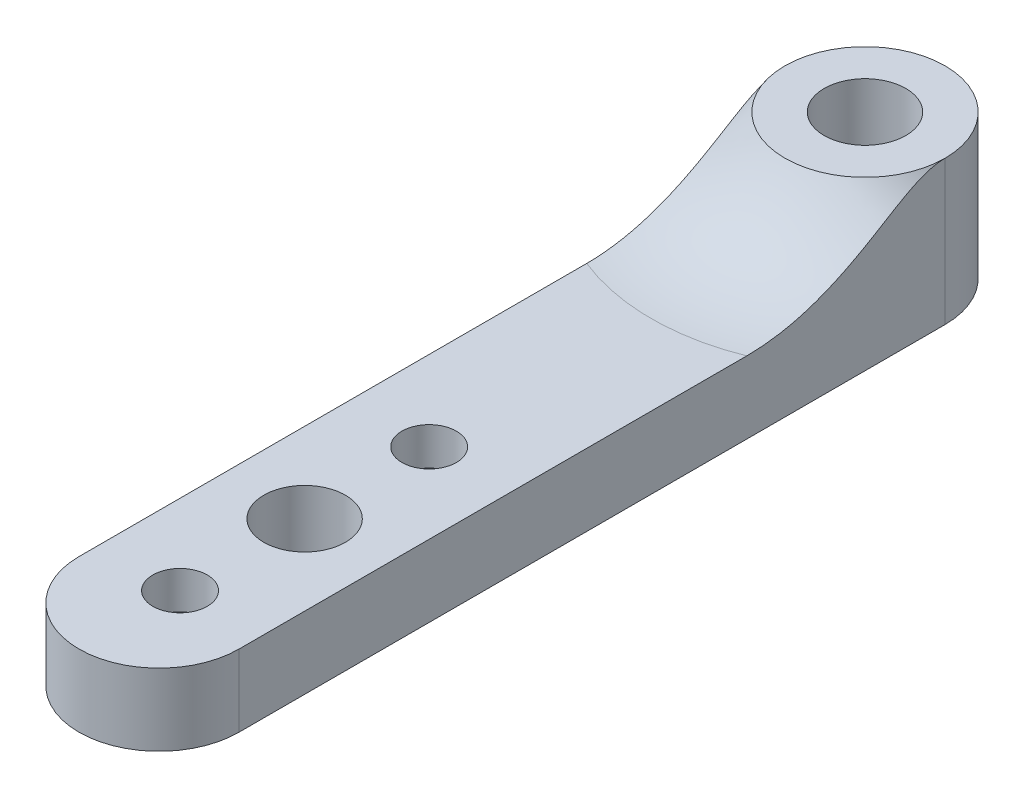
ISO-10303-21;
HEADER;
FILE_DESCRIPTION(('STEP AP214'),'2;1');
FILE_NAME('part.step','',(''),(''),'','','');
FILE_SCHEMA(('AUTOMOTIVE_DESIGN { 1 0 10303 214 1 1 1 1 }'));
ENDSEC;
DATA;
#1=APPLICATION_CONTEXT('core data for automotive mechanical design processes');
#2=APPLICATION_PROTOCOL_DEFINITION('international standard','automotive_design',2000,#1);
#3=PRODUCT_CONTEXT('',#1,'mechanical');
#4=PRODUCT('Part','Part','',(#3));
#5=PRODUCT_RELATED_PRODUCT_CATEGORY('part','',(#4));
#6=PRODUCT_DEFINITION_FORMATION('','',#4);
#7=PRODUCT_DEFINITION_CONTEXT('part definition',#1,'design');
#8=PRODUCT_DEFINITION('design','',#6,#7);
#9=PRODUCT_DEFINITION_SHAPE('','',#8);
#10=(LENGTH_UNIT() NAMED_UNIT(*) SI_UNIT(.MILLI.,.METRE.));
#11=(NAMED_UNIT(*) PLANE_ANGLE_UNIT() SI_UNIT($,.RADIAN.));
#12=(NAMED_UNIT(*) SI_UNIT($,.STERADIAN.) SOLID_ANGLE_UNIT());
#13=UNCERTAINTY_MEASURE_WITH_UNIT(LENGTH_MEASURE(1.E-05),#10,'distance_accuracy_value','');
#14=(GEOMETRIC_REPRESENTATION_CONTEXT(3) GLOBAL_UNCERTAINTY_ASSIGNED_CONTEXT((#13)) GLOBAL_UNIT_ASSIGNED_CONTEXT((#10,
#11,#12)) REPRESENTATION_CONTEXT('',''));
#15=CARTESIAN_POINT('',(0.,0.,0.));
#16=DIRECTION('',(0.,0.,1.));
#17=DIRECTION('',(1.,0.,0.));
#18=AXIS2_PLACEMENT_3D('',#15,#16,#17);
#19=CARTESIAN_POINT('',(0.,4.5,-17.5));
#20=DIRECTION('',(0.,-1.,0.));
#21=DIRECTION('',(0.,0.,-1.));
#22=AXIS2_PLACEMENT_3D('',#19,#20,#21);
#23=CYLINDRICAL_SURFACE('',#22,5.);
#24=CARTESIAN_POINT('',(0.,9.,-17.5));
#25=DIRECTION('',(0.,1.,0.));
#26=DIRECTION('',(0.,0.,1.));
#27=AXIS2_PLACEMENT_3D('',#24,#25,#26);
#28=CIRCLE('',#27,5.);
#29=CARTESIAN_POINT('',(5.,9.,-17.5));
#30=VERTEX_POINT('',#29);
#31=CARTESIAN_POINT('',(-5.,9.,-17.5));
#32=VERTEX_POINT('',#31);
#33=EDGE_CURVE('E116',#30,#32,#28,.T.);
#34=ORIENTED_EDGE('',*,*,#33,.F.);
#35=DIRECTION('',(0.,-1.,0.));
#36=VECTOR('',#35,1.);
#37=CARTESIAN_POINT('',(5.,4.5,-17.5));
#38=LINE('',#37,#36);
#39=CARTESIAN_POINT('',(5.,0.,-17.5));
#40=VERTEX_POINT('',#39);
#41=EDGE_CURVE('E92',#30,#40,#38,.T.);
#42=ORIENTED_EDGE('',*,*,#41,.T.);
#43=CARTESIAN_POINT('',(0.,0.,-17.5));
#44=DIRECTION('',(0.,1.,0.));
#45=DIRECTION('',(0.,0.,1.));
#46=AXIS2_PLACEMENT_3D('',#43,#44,#45);
#47=CIRCLE('',#46,5.);
#48=CARTESIAN_POINT('',(-5.,0.,-17.5));
#49=VERTEX_POINT('',#48);
#50=EDGE_CURVE('E123',#40,#49,#47,.T.);
#51=ORIENTED_EDGE('',*,*,#50,.T.);
#52=DIRECTION('',(0.,-1.,0.));
#53=VECTOR('',#52,1.);
#54=CARTESIAN_POINT('',(-5.,4.5,-17.5));
#55=LINE('',#54,#53);
#56=EDGE_CURVE('E138',#32,#49,#55,.T.);
#57=ORIENTED_EDGE('',*,*,#56,.F.);
#58=EDGE_LOOP('',(#34,#42,#51,#57));
#59=FACE_BOUND('',#58,.T.);
#60=ADVANCED_FACE('F36',(#59),#23,.T.);
#61=CARTESIAN_POINT('',(-5.,4.5,17.5));
#62=DIRECTION('',(1.,0.,0.));
#63=DIRECTION('',(0.,0.,-1.));
#64=AXIS2_PLACEMENT_3D('',#61,#62,#63);
#65=PLANE('',#64);
#66=DIRECTION('',(0.,0.,1.));
#67=VECTOR('',#66,1.);
#68=CARTESIAN_POINT('',(-5.,0.,17.5));
#69=LINE('',#68,#67);
#70=CARTESIAN_POINT('',(-5.,0.,26.5946336704579));
#71=VERTEX_POINT('',#70);
#72=EDGE_CURVE('E133',#49,#71,#69,.T.);
#73=ORIENTED_EDGE('',*,*,#72,.T.);
#74=DIRECTION('',(0.,-1.,0.));
#75=VECTOR('',#74,1.);
#76=CARTESIAN_POINT('',(-5.,21.7817446545309,26.5946336704579));
#77=LINE('',#76,#75);
#78=CARTESIAN_POINT('',(-5.,4.5,26.5946336704579));
#79=VERTEX_POINT('',#78);
#80=EDGE_CURVE('E102',#79,#71,#77,.T.);
#81=ORIENTED_EDGE('',*,*,#80,.F.);
#82=DIRECTION('',(0.,0.,1.));
#83=VECTOR('',#82,1.);
#84=CARTESIAN_POINT('',(-5.,4.5,17.5));
#85=LINE('',#84,#83);
#86=CARTESIAN_POINT('',(-5.,4.5,-5.11991658176528));
#87=VERTEX_POINT('',#86);
#88=EDGE_CURVE('E93',#87,#79,#85,.T.);
#89=ORIENTED_EDGE('',*,*,#88,.F.);
#90=CARTESIAN_POINT('',(-5.,4.5,-5.11991658176528));
#91=CARTESIAN_POINT('',(-5.,4.49999840549545,-5.29648181579723));
#92=CARTESIAN_POINT('',(-5.,4.50402126784642,-5.47301835966738));
#93=CARTESIAN_POINT('',(-5.,4.51994388788278,-5.82571573271794));
#94=CARTESIAN_POINT('',(-5.,4.53184269689178,-6.00187660458544));
#95=CARTESIAN_POINT('',(-5.,4.5790562478808,-6.52893211107319));
#96=CARTESIAN_POINT('',(-5.,4.62588901278066,-6.87885301045987));
#97=CARTESIAN_POINT('',(-5.,4.74799056085634,-7.57083933294123));
#98=CARTESIAN_POINT('',(-5.,4.8230395068316,-7.91294433442181));
#99=CARTESIAN_POINT('',(-5.,4.99942109009107,-8.59033950487401));
#100=CARTESIAN_POINT('',(-5.,5.10075775993142,-8.92562861976663));
#101=CARTESIAN_POINT('',(-5.,5.30621601387656,-9.52701597696135));
#102=CARTESIAN_POINT('',(-5.,5.40638556231449,-9.79448193987534));
#103=CARTESIAN_POINT('',(-5.,5.62080341708264,-10.3236568640424));
#104=CARTESIAN_POINT('',(-5.,5.73505015644983,-10.5853664622339));
#105=CARTESIAN_POINT('',(-5.,5.97586668590197,-11.1033151255615));
#106=CARTESIAN_POINT('',(-5.,6.10244795902924,-11.3595488169908));
#107=CARTESIAN_POINT('',(-5.,6.36565293956558,-11.8667286035166));
#108=CARTESIAN_POINT('',(-5.,6.50227531849063,-12.117675392462));
#109=CARTESIAN_POINT('',(-5.,6.72023308774814,-12.5041831534404));
#110=CARTESIAN_POINT('',(-5.,6.79900066904112,-12.641208333475));
#111=CARTESIAN_POINT('',(-5.,6.95826214067962,-12.9142528066188));
#112=CARTESIAN_POINT('',(-5.,7.03875604380955,-13.0502720922689));
#113=CARTESIAN_POINT('',(-5.,7.20090155578766,-13.3217439747389));
#114=CARTESIAN_POINT('',(-5.,7.28255393112967,-13.4571961114538));
#115=CARTESIAN_POINT('',(-5.,7.44620521482107,-13.7278848558966));
#116=CARTESIAN_POINT('',(-5.,7.52820411324867,-13.863121469645));
#117=CARTESIAN_POINT('',(-5.,7.69165565741036,-14.1340121555492));
#118=CARTESIAN_POINT('',(-5.,7.77310803062369,-14.2696663929483));
#119=CARTESIAN_POINT('',(-5.,7.93424650217102,-14.5420550112465));
#120=CARTESIAN_POINT('',(-5.,8.01393234208063,-14.6787895462643));
#121=CARTESIAN_POINT('',(-5.,8.16985605257228,-14.9540050276971));
#122=CARTESIAN_POINT('',(-5.,8.2460980340252,-15.0924836252912));
#123=CARTESIAN_POINT('',(-5.,8.39310819888435,-15.3722987187787));
#124=CARTESIAN_POINT('',(-5.,8.46387839508441,-15.5136341394253));
#125=CARTESIAN_POINT('',(-5.,8.58287468513335,-15.7696479007915));
#126=CARTESIAN_POINT('',(-5.,8.63268929566274,-15.8835804825039));
#127=CARTESIAN_POINT('',(-5.,8.72536806041057,-16.1143272272726));
#128=CARTESIAN_POINT('',(-5.,8.76822990025216,-16.2311423349921));
#129=CARTESIAN_POINT('',(-5.,8.84458191982192,-16.4669526784213));
#130=CARTESIAN_POINT('',(-5.,8.8781348763189,-16.5859272435732));
#131=CARTESIAN_POINT('',(-5.,8.93400144195459,-16.8264426348765));
#132=CARTESIAN_POINT('',(-5.,8.956326587114,-16.9479806927949));
#133=CARTESIAN_POINT('',(-5.,8.98129417927739,-17.1414076447847));
#134=CARTESIAN_POINT('',(-5.,8.98826445230985,-17.2127514064984));
#135=CARTESIAN_POINT('',(-5.,8.99763873672288,-17.3560557270254));
#136=CARTESIAN_POINT('',(-5.,9.00002227175152,-17.4280176177274));
#137=CARTESIAN_POINT('',(-5.,9.,-17.5));
#138=B_SPLINE_CURVE_WITH_KNOTS('',3,(#90,#91,#92,#93,#94,#95,#96,#97,#98,#99,#100,#101,#102,
#103,#104,#105,#106,#107,#108,#109,#110,#111,#112,#113,#114,#115,#116,#117,#118,#119,#120,#121,
#122,#123,#124,#125,#126,#127,#128,#129,#130,#131,#132,#133,#134,#135,#136,#137),.UNSPECIFIED.,
.F.,.F.,(4,2,2,2,2,2,2,2,2,2,2,2,2,2,2,2,2,2,2,2,2,2,2,4),(0.,0.529596670185663,
1.05912956080555,2.11684002814387,3.16647494253158,4.21627096699879,5.07267525956277,
5.92898430985545,6.78609831350219,7.6430991204991,8.11724230026892,8.59138899255668,
9.06586556542707,9.54032864370225,10.0150129440297,10.4897662332263,10.9639369735917,
11.4379324523076,11.8108050822626,12.1838015771886,12.5542178974807,12.9242528518082,
13.1391667154999,13.3550378030074),.UNSPECIFIED.);
#139=EDGE_CURVE('E11',#87,#32,#138,.T.);
#140=ORIENTED_EDGE('',*,*,#139,.T.);
#141=ORIENTED_EDGE('',*,*,#56,.T.);
#142=EDGE_LOOP('',(#73,#81,#89,#140,#141));
#143=FACE_BOUND('',#142,.T.);
#144=ADVANCED_FACE('F149',(#143),#65,.F.);
#145=CARTESIAN_POINT('',(5.,4.5,17.5));
#146=DIRECTION('',(-1.,0.,0.));
#147=DIRECTION('',(0.,0.,1.));
#148=AXIS2_PLACEMENT_3D('',#145,#146,#147);
#149=PLANE('',#148);
#150=DIRECTION('',(0.,0.,-1.));
#151=VECTOR('',#150,1.);
#152=CARTESIAN_POINT('',(5.,0.,17.5));
#153=LINE('',#152,#151);
#154=CARTESIAN_POINT('',(5.,0.,26.5946336704579));
#155=VERTEX_POINT('',#154);
#156=EDGE_CURVE('E129',#155,#40,#153,.T.);
#157=ORIENTED_EDGE('',*,*,#156,.T.);
#158=ORIENTED_EDGE('',*,*,#41,.F.);
#159=CARTESIAN_POINT('',(5.,9.,-17.5));
#160=CARTESIAN_POINT('',(5.,9.00000893187561,-17.4407571857202));
#161=CARTESIAN_POINT('',(5.,8.99840009437402,-17.3815266132419));
#162=CARTESIAN_POINT('',(5.,8.99202876035376,-17.2632544098129));
#163=CARTESIAN_POINT('',(5.,8.98726731139348,-17.2042127226449));
#164=CARTESIAN_POINT('',(5.,8.96842430181486,-17.0280181132181));
#165=CARTESIAN_POINT('',(5.,8.94978278565232,-16.9113310846864));
#166=CARTESIAN_POINT('',(5.,8.90230736154222,-16.6827192850576));
#167=CARTESIAN_POINT('',(5.,8.8736991741825,-16.5707460207778));
#168=CARTESIAN_POINT('',(5.,8.80800109977393,-16.3492956485838));
#169=CARTESIAN_POINT('',(5.,8.77090689076764,-16.239819843986));
#170=CARTESIAN_POINT('',(5.,8.65944374051665,-15.9414933196581));
#171=CARTESIAN_POINT('',(5.,8.57811070655369,-15.7552728604319));
#172=CARTESIAN_POINT('',(5.,8.40277292471352,-15.3888247195622));
#173=CARTESIAN_POINT('',(5.,8.30875044569528,-15.2086058714358));
#174=CARTESIAN_POINT('',(5.,8.11316566426022,-14.8513923676943));
#175=CARTESIAN_POINT('',(5.,8.01157379232076,-14.6744141255171));
#176=CARTESIAN_POINT('',(5.,7.80500355423442,-14.3226125895224));
#177=CARTESIAN_POINT('',(5.,7.70002714763805,-14.1477881269809));
#178=CARTESIAN_POINT('',(5.,7.48682567963583,-13.7946600515054));
#179=CARTESIAN_POINT('',(5.,7.37858120057766,-13.6163682301553));
#180=CARTESIAN_POINT('',(5.,7.16323400774345,-13.2590631515509));
#181=CARTESIAN_POINT('',(5.,7.05613142898407,-13.0800498123593));
#182=CARTESIAN_POINT('',(5.,6.84488124287006,-12.7208346361355));
#183=CARTESIAN_POINT('',(5.,6.7407273815143,-12.5406364993791));
#184=CARTESIAN_POINT('',(5.,6.53636676638719,-12.1780155341045));
#185=CARTESIAN_POINT('',(5.,6.43615986332677,-11.995592790072));
#186=CARTESIAN_POINT('',(5.,6.24120705665234,-11.6289733585168));
#187=CARTESIAN_POINT('',(5.,6.14643700007078,-11.4447895847986));
#188=CARTESIAN_POINT('',(5.,5.9627256594043,-11.0735389332999));
#189=CARTESIAN_POINT('',(5.,5.87378449519792,-10.8864719963212));
#190=CARTESIAN_POINT('',(5.,5.61678795147896,-10.320451895944));
#191=CARTESIAN_POINT('',(5.,5.45867079781858,-9.93688480122822));
#192=CARTESIAN_POINT('',(5.,5.17536373698116,-9.16043229289621));
#193=CARTESIAN_POINT('',(5.,5.04997258997727,-8.76762084224966));
#194=CARTESIAN_POINT('',(5.,4.83527822520325,-7.97243390610871));
#195=CARTESIAN_POINT('',(5.,4.74594962223819,-7.57006536005334));
#196=CARTESIAN_POINT('',(5.,4.61861603543272,-6.8270344533577));
#197=CARTESIAN_POINT('',(5.,4.57449135018649,-6.48742639817937));
#198=CARTESIAN_POINT('',(5.,4.53000382038349,-5.97593160131117));
#199=CARTESIAN_POINT('',(5.,4.51879095517126,-5.80494327635177));
#200=CARTESIAN_POINT('',(5.,4.50378742020659,-5.46261668731822));
#201=CARTESIAN_POINT('',(5.,4.49999786261868,-5.29127837465745));
#202=CARTESIAN_POINT('',(5.,4.5,-5.11991658176528));
#203=B_SPLINE_CURVE_WITH_KNOTS('',3,(#159,#160,#161,#162,#163,#164,#165,#166,#167,#168,#169,
#170,#171,#172,#173,#174,#175,#176,#177,#178,#179,#180,#181,#182,#183,#184,#185,#186,#187,#188,
#189,#190,#191,#192,#193,#194,#195,#196,#197,#198,#199,#200,#201,#202),.UNSPECIFIED.,.F.,.F.,(4,
2,2,2,2,2,2,2,2,2,2,2,2,2,2,2,2,2,2,2,2,4),(0.,0.177683781197214,0.35530855075048,
0.709171510429659,1.05549186916257,1.40198900417043,2.01071252515322,2.62029560475884,
3.23239930772968,3.84415476847003,4.46989024990625,5.0956989147171,5.72006208176829,
6.34440161029239,6.96570972074269,7.5870306051717,8.83037167554732,10.0658767292057,
11.300510561635,12.3266475481923,12.8405707795262,13.3545710012691),.UNSPECIFIED.);
#204=CARTESIAN_POINT('',(5.,4.5,-5.11991658176528));
#205=VERTEX_POINT('',#204);
#206=EDGE_CURVE('E50',#30,#205,#203,.T.);
#207=ORIENTED_EDGE('',*,*,#206,.T.);
#208=DIRECTION('',(0.,0.,-1.));
#209=VECTOR('',#208,1.);
#210=CARTESIAN_POINT('',(5.,4.5,17.5));
#211=LINE('',#210,#209);
#212=CARTESIAN_POINT('',(5.,4.5,26.5946336704579));
#213=VERTEX_POINT('',#212);
#214=EDGE_CURVE('E86',#213,#205,#211,.T.);
#215=ORIENTED_EDGE('',*,*,#214,.F.);
#216=DIRECTION('',(0.,-1.,0.));
#217=VECTOR('',#216,1.);
#218=CARTESIAN_POINT('',(5.,21.7817446545309,26.5946336704579));
#219=LINE('',#218,#217);
#220=EDGE_CURVE('E90',#213,#155,#219,.T.);
#221=ORIENTED_EDGE('',*,*,#220,.T.);
#222=EDGE_LOOP('',(#157,#158,#207,#215,#221));
#223=FACE_BOUND('',#222,.T.);
#224=ADVANCED_FACE('F88',(#223),#149,.F.);
#225=CARTESIAN_POINT('',(0.,4.5,-17.5));
#226=DIRECTION('',(0.,1.,0.));
#227=DIRECTION('',(0.,0.,1.));
#228=AXIS2_PLACEMENT_3D('',#225,#226,#227);
#229=PLANE('',#228);
#230=CARTESIAN_POINT('',(0.,4.5,9.72));
#231=DIRECTION('',(0.,1.,0.));
#232=DIRECTION('',(0.,0.,1.));
#233=AXIS2_PLACEMENT_3D('',#230,#231,#232);
#234=CIRCLE('',#233,1.7);
#235=CARTESIAN_POINT('',(0.,4.5,11.42));
#236=VERTEX_POINT('',#235);
#237=EDGE_CURVE('E241',#236,#236,#234,.T.);
#238=ORIENTED_EDGE('',*,*,#237,.F.);
#239=EDGE_LOOP('',(#238));
#240=FACE_BOUND('',#239,.T.);
#241=CARTESIAN_POINT('',(0.,4.5,25.28));
#242=DIRECTION('',(0.,1.,0.));
#243=DIRECTION('',(0.,0.,1.));
#244=AXIS2_PLACEMENT_3D('',#241,#242,#243);
#245=CIRCLE('',#244,1.7);
#246=CARTESIAN_POINT('',(0.,4.5,26.98));
#247=VERTEX_POINT('',#246);
#248=EDGE_CURVE('E108',#247,#247,#245,.T.);
#249=ORIENTED_EDGE('',*,*,#248,.F.);
#250=EDGE_LOOP('',(#249));
#251=FACE_BOUND('',#250,.T.);
#252=ORIENTED_EDGE('',*,*,#214,.T.);
#253=CARTESIAN_POINT('',(0.,4.5,-17.5));
#254=DIRECTION('',(0.,1.,0.));
#255=DIRECTION('',(0.,0.,1.));
#256=AXIS2_PLACEMENT_3D('',#253,#254,#255);
#257=CIRCLE('',#256,13.351646544245);
#258=EDGE_CURVE('E63',#205,#87,#257,.F.);
#259=ORIENTED_EDGE('',*,*,#258,.T.);
#260=ORIENTED_EDGE('',*,*,#88,.T.);
#261=CARTESIAN_POINT('',(0.,4.5,26.5946336704579));
#262=DIRECTION('',(0.,1.,0.));
#263=DIRECTION('',(0.,0.,1.));
#264=AXIS2_PLACEMENT_3D('',#261,#262,#263);
#265=CIRCLE('',#264,5.);
#266=EDGE_CURVE('E96',#213,#79,#265,.F.);
#267=ORIENTED_EDGE('',*,*,#266,.F.);
#268=EDGE_LOOP('',(#252,#259,#260,#267));
#269=FACE_BOUND('',#268,.T.);
#270=CARTESIAN_POINT('',(0.,4.5,17.5));
#271=DIRECTION('',(0.,1.,0.));
#272=DIRECTION('',(0.,0.,1.));
#273=AXIS2_PLACEMENT_3D('',#270,#271,#272);
#274=CIRCLE('',#273,2.55);
#275=CARTESIAN_POINT('',(0.,4.5,20.05));
#276=VERTEX_POINT('',#275);
#277=EDGE_CURVE('E119',#276,#276,#274,.T.);
#278=ORIENTED_EDGE('',*,*,#277,.F.);
#279=EDGE_LOOP('',(#278));
#280=FACE_BOUND('',#279,.T.);
#281=ADVANCED_FACE('F97',(#240,#251,#269,#280),#229,.T.);
#282=CARTESIAN_POINT('',(0.,0.,-17.5));
#283=DIRECTION('',(0.,1.,0.));
#284=DIRECTION('',(0.,0.,1.));
#285=AXIS2_PLACEMENT_3D('',#282,#283,#284);
#286=PLANE('',#285);
#287=CARTESIAN_POINT('',(0.,0.,9.72));
#288=DIRECTION('',(0.,-1.,0.));
#289=DIRECTION('',(0.,0.,-1.));
#290=AXIS2_PLACEMENT_3D('',#287,#288,#289);
#291=CIRCLE('',#290,3.35);
#292=CARTESIAN_POINT('',(0.,0.,6.37));
#293=VERTEX_POINT('',#292);
#294=EDGE_CURVE('E182',#293,#293,#291,.T.);
#295=ORIENTED_EDGE('',*,*,#294,.F.);
#296=EDGE_LOOP('',(#295));
#297=FACE_BOUND('',#296,.T.);
#298=CARTESIAN_POINT('',(0.,0.,25.28));
#299=DIRECTION('',(0.,-1.,0.));
#300=DIRECTION('',(0.,0.,-1.));
#301=AXIS2_PLACEMENT_3D('',#298,#299,#300);
#302=CIRCLE('',#301,3.35);
#303=CARTESIAN_POINT('',(0.,0.,21.93));
#304=VERTEX_POINT('',#303);
#305=EDGE_CURVE('E186',#304,#304,#302,.T.);
#306=ORIENTED_EDGE('',*,*,#305,.F.);
#307=EDGE_LOOP('',(#306));
#308=FACE_BOUND('',#307,.T.);
#309=CARTESIAN_POINT('',(0.,0.,-17.5));
#310=DIRECTION('',(0.,1.,0.));
#311=DIRECTION('',(0.,0.,1.));
#312=AXIS2_PLACEMENT_3D('',#309,#310,#311);
#313=CIRCLE('',#312,2.55);
#314=CARTESIAN_POINT('',(0.,0.,-14.95));
#315=VERTEX_POINT('',#314);
#316=EDGE_CURVE('E120',#315,#315,#313,.T.);
#317=ORIENTED_EDGE('',*,*,#316,.T.);
#318=EDGE_LOOP('',(#317));
#319=FACE_BOUND('',#318,.T.);
#320=CARTESIAN_POINT('',(0.,0.,17.5));
#321=DIRECTION('',(0.,1.,0.));
#322=DIRECTION('',(0.,0.,1.));
#323=AXIS2_PLACEMENT_3D('',#320,#321,#322);
#324=CIRCLE('',#323,2.55);
#325=CARTESIAN_POINT('',(0.,0.,20.05));
#326=VERTEX_POINT('',#325);
#327=EDGE_CURVE('E124',#326,#326,#324,.T.);
#328=ORIENTED_EDGE('',*,*,#327,.T.);
#329=EDGE_LOOP('',(#328));
#330=FACE_BOUND('',#329,.T.);
#331=ORIENTED_EDGE('',*,*,#50,.F.);
#332=ORIENTED_EDGE('',*,*,#156,.F.);
#333=CARTESIAN_POINT('',(0.,0.,26.5946336704579));
#334=DIRECTION('',(0.,-1.,0.));
#335=DIRECTION('',(0.,0.,-1.));
#336=AXIS2_PLACEMENT_3D('',#333,#334,#335);
#337=CIRCLE('',#336,5.);
#338=EDGE_CURVE('E106',#155,#71,#337,.T.);
#339=ORIENTED_EDGE('',*,*,#338,.T.);
#340=ORIENTED_EDGE('',*,*,#72,.F.);
#341=EDGE_LOOP('',(#331,#332,#339,#340));
#342=FACE_BOUND('',#341,.T.);
#343=ADVANCED_FACE('F150',(#297,#308,#319,#330,#342),#286,.F.);
#344=CARTESIAN_POINT('',(0.,0.,17.5));
#345=DIRECTION('',(0.,1.,0.));
#346=DIRECTION('',(0.,0.,1.));
#347=AXIS2_PLACEMENT_3D('',#344,#345,#346);
#348=CYLINDRICAL_SURFACE('',#347,2.55);
#349=ORIENTED_EDGE('',*,*,#327,.F.);
#350=EDGE_LOOP('',(#349));
#351=FACE_BOUND('',#350,.T.);
#352=ORIENTED_EDGE('',*,*,#277,.T.);
#353=EDGE_LOOP('',(#352));
#354=FACE_BOUND('',#353,.T.);
#355=ADVANCED_FACE('F169',(#351,#354),#348,.F.);
#356=CARTESIAN_POINT('',(0.,0.,-17.5));
#357=DIRECTION('',(0.,1.,0.));
#358=DIRECTION('',(0.,0.,1.));
#359=AXIS2_PLACEMENT_3D('',#356,#357,#358);
#360=CYLINDRICAL_SURFACE('',#359,2.55);
#361=ORIENTED_EDGE('',*,*,#316,.F.);
#362=EDGE_LOOP('',(#361));
#363=FACE_BOUND('',#362,.T.);
#364=CARTESIAN_POINT('',(0.,9.,-17.5));
#365=DIRECTION('',(0.,-1.,0.));
#366=DIRECTION('',(0.,0.,-1.));
#367=AXIS2_PLACEMENT_3D('',#364,#365,#366);
#368=CIRCLE('',#367,2.55);
#369=CARTESIAN_POINT('',(0.,9.,-20.05));
#370=VERTEX_POINT('',#369);
#371=EDGE_CURVE('E112',#370,#370,#368,.T.);
#372=ORIENTED_EDGE('',*,*,#371,.F.);
#373=EDGE_LOOP('',(#372));
#374=FACE_BOUND('',#373,.T.);
#375=ADVANCED_FACE('F175',(#363,#374),#360,.F.);
#376=CARTESIAN_POINT('',(0.,9.,-17.5));
#377=DIRECTION('',(0.,1.,0.));
#378=DIRECTION('',(0.,0.,1.));
#379=AXIS2_PLACEMENT_3D('',#376,#377,#378);
#380=PLANE('',#379);
#381=ORIENTED_EDGE('',*,*,#371,.T.);
#382=EDGE_LOOP('',(#381));
#383=FACE_BOUND('',#382,.T.);
#384=ORIENTED_EDGE('',*,*,#33,.T.);
#385=EDGE_CURVE('E115',#32,#30,#28,.T.);
#386=ORIENTED_EDGE('',*,*,#385,.T.);
#387=EDGE_LOOP('',(#384,#386));
#388=FACE_BOUND('',#387,.T.);
#389=ADVANCED_FACE('F164',(#383,#388),#380,.T.);
#390=CARTESIAN_POINT('',(0.,21.7817446545309,26.5946336704579));
#391=DIRECTION('',(0.,-1.,0.));
#392=DIRECTION('',(0.,0.,-1.));
#393=AXIS2_PLACEMENT_3D('',#390,#391,#392);
#394=CYLINDRICAL_SURFACE('',#393,5.);
#395=ORIENTED_EDGE('',*,*,#220,.F.);
#396=ORIENTED_EDGE('',*,*,#266,.T.);
#397=ORIENTED_EDGE('',*,*,#80,.T.);
#398=ORIENTED_EDGE('',*,*,#338,.F.);
#399=EDGE_LOOP('',(#395,#396,#397,#398));
#400=FACE_BOUND('',#399,.T.);
#401=ADVANCED_FACE('F104',(#400),#394,.T.);
#402=CARTESIAN_POINT('',(0.,0.,25.28));
#403=DIRECTION('',(0.,-1.,0.));
#404=DIRECTION('',(0.,0.,-1.));
#405=AXIS2_PLACEMENT_3D('',#402,#403,#404);
#406=CYLINDRICAL_SURFACE('',#405,1.7);
#407=CARTESIAN_POINT('',(0.,2.15,25.28));
#408=DIRECTION('',(0.,-1.,0.));
#409=DIRECTION('',(0.,0.,-1.));
#410=AXIS2_PLACEMENT_3D('',#407,#408,#409);
#411=CIRCLE('',#410,1.7);
#412=CARTESIAN_POINT('',(0.,2.15,23.58));
#413=VERTEX_POINT('',#412);
#414=EDGE_CURVE('E248',#413,#413,#411,.T.);
#415=ORIENTED_EDGE('',*,*,#414,.T.);
#416=EDGE_LOOP('',(#415));
#417=FACE_BOUND('',#416,.T.);
#418=ORIENTED_EDGE('',*,*,#248,.T.);
#419=EDGE_LOOP('',(#418));
#420=FACE_BOUND('',#419,.T.);
#421=ADVANCED_FACE('F203',(#417,#420),#406,.F.);
#422=CARTESIAN_POINT('',(1.7,2.15,25.28));
#423=DIRECTION('',(0.,1.,0.));
#424=DIRECTION('',(0.,0.,1.));
#425=AXIS2_PLACEMENT_3D('',#422,#423,#424);
#426=PLANE('',#425);
#427=ORIENTED_EDGE('',*,*,#414,.F.);
#428=EDGE_LOOP('',(#427));
#429=FACE_BOUND('',#428,.T.);
#430=CARTESIAN_POINT('',(0.,2.15,25.28));
#431=DIRECTION('',(0.,-1.,0.));
#432=DIRECTION('',(0.,0.,-1.));
#433=AXIS2_PLACEMENT_3D('',#430,#431,#432);
#434=CIRCLE('',#433,3.35);
#435=CARTESIAN_POINT('',(0.,2.15,21.93));
#436=VERTEX_POINT('',#435);
#437=EDGE_CURVE('E245',#436,#436,#434,.T.);
#438=ORIENTED_EDGE('',*,*,#437,.T.);
#439=EDGE_LOOP('',(#438));
#440=FACE_BOUND('',#439,.T.);
#441=ADVANCED_FACE('F208',(#429,#440),#426,.F.);
#442=CARTESIAN_POINT('',(0.,0.,25.28));
#443=DIRECTION('',(0.,-1.,0.));
#444=DIRECTION('',(0.,0.,-1.));
#445=AXIS2_PLACEMENT_3D('',#442,#443,#444);
#446=CYLINDRICAL_SURFACE('',#445,3.35);
#447=ORIENTED_EDGE('',*,*,#437,.F.);
#448=EDGE_LOOP('',(#447));
#449=FACE_BOUND('',#448,.T.);
#450=ORIENTED_EDGE('',*,*,#305,.T.);
#451=EDGE_LOOP('',(#450));
#452=FACE_BOUND('',#451,.T.);
#453=ADVANCED_FACE('F212',(#449,#452),#446,.F.);
#454=CARTESIAN_POINT('',(0.,0.,9.72));
#455=DIRECTION('',(0.,-1.,0.));
#456=DIRECTION('',(0.,0.,-1.));
#457=AXIS2_PLACEMENT_3D('',#454,#455,#456);
#458=CYLINDRICAL_SURFACE('',#457,1.7);
#459=CARTESIAN_POINT('',(0.,2.15,9.72));
#460=DIRECTION('',(0.,-1.,0.));
#461=DIRECTION('',(0.,0.,-1.));
#462=AXIS2_PLACEMENT_3D('',#459,#460,#461);
#463=CIRCLE('',#462,1.7);
#464=CARTESIAN_POINT('',(0.,2.15,8.02));
#465=VERTEX_POINT('',#464);
#466=EDGE_CURVE('E236',#465,#465,#463,.T.);
#467=ORIENTED_EDGE('',*,*,#466,.T.);
#468=EDGE_LOOP('',(#467));
#469=FACE_BOUND('',#468,.T.);
#470=ORIENTED_EDGE('',*,*,#237,.T.);
#471=EDGE_LOOP('',(#470));
#472=FACE_BOUND('',#471,.T.);
#473=ADVANCED_FACE('F216',(#469,#472),#458,.F.);
#474=CARTESIAN_POINT('',(1.7,2.15,9.72));
#475=DIRECTION('',(0.,1.,0.));
#476=DIRECTION('',(0.,0.,1.));
#477=AXIS2_PLACEMENT_3D('',#474,#475,#476);
#478=PLANE('',#477);
#479=ORIENTED_EDGE('',*,*,#466,.F.);
#480=EDGE_LOOP('',(#479));
#481=FACE_BOUND('',#480,.T.);
#482=CARTESIAN_POINT('',(0.,2.15,9.72));
#483=DIRECTION('',(0.,-1.,0.));
#484=DIRECTION('',(0.,0.,-1.));
#485=AXIS2_PLACEMENT_3D('',#482,#483,#484);
#486=CIRCLE('',#485,3.35);
#487=CARTESIAN_POINT('',(0.,2.15,6.37));
#488=VERTEX_POINT('',#487);
#489=EDGE_CURVE('E234',#488,#488,#486,.T.);
#490=ORIENTED_EDGE('',*,*,#489,.T.);
#491=EDGE_LOOP('',(#490));
#492=FACE_BOUND('',#491,.T.);
#493=ADVANCED_FACE('F220',(#481,#492),#478,.F.);
#494=CARTESIAN_POINT('',(0.,0.,9.72));
#495=DIRECTION('',(0.,-1.,0.));
#496=DIRECTION('',(0.,0.,-1.));
#497=AXIS2_PLACEMENT_3D('',#494,#495,#496);
#498=CYLINDRICAL_SURFACE('',#497,3.35);
#499=ORIENTED_EDGE('',*,*,#489,.F.);
#500=EDGE_LOOP('',(#499));
#501=FACE_BOUND('',#500,.T.);
#502=ORIENTED_EDGE('',*,*,#294,.T.);
#503=EDGE_LOOP('',(#502));
#504=FACE_BOUND('',#503,.T.);
#505=ADVANCED_FACE('F224',(#501,#504),#498,.F.);
#506=CARTESIAN_POINT('',(0.,14.5,-17.5));
#507=DIRECTION('',(0.,1.,0.));
#508=DIRECTION('',(0.,0.,1.));
#509=AXIS2_PLACEMENT_3D('',#506,#507,#508);
#510=TOROIDAL_SURFACE('',#509,13.351646544245,10.);
#511=ORIENTED_EDGE('',*,*,#139,.F.);
#512=ORIENTED_EDGE('',*,*,#258,.F.);
#513=ORIENTED_EDGE('',*,*,#206,.F.);
#514=ORIENTED_EDGE('',*,*,#385,.F.);
#515=EDGE_LOOP('',(#511,#512,#513,#514));
#516=FACE_BOUND('',#515,.T.);
#517=ADVANCED_FACE('F38',(#516),#510,.F.);
#518=CLOSED_SHELL('',(#60,#144,#224,#281,#343,#355,#375,#389,#401,#421,#441,#453,#473,#493,#505,#517));
#519=MANIFOLD_SOLID_BREP('B2',#518);
#520=ADVANCED_BREP_SHAPE_REPRESENTATION('',(#18,#519),#14);
#521=SHAPE_DEFINITION_REPRESENTATION(#9,#520);
ENDSEC;
END-ISO-10303-21;
